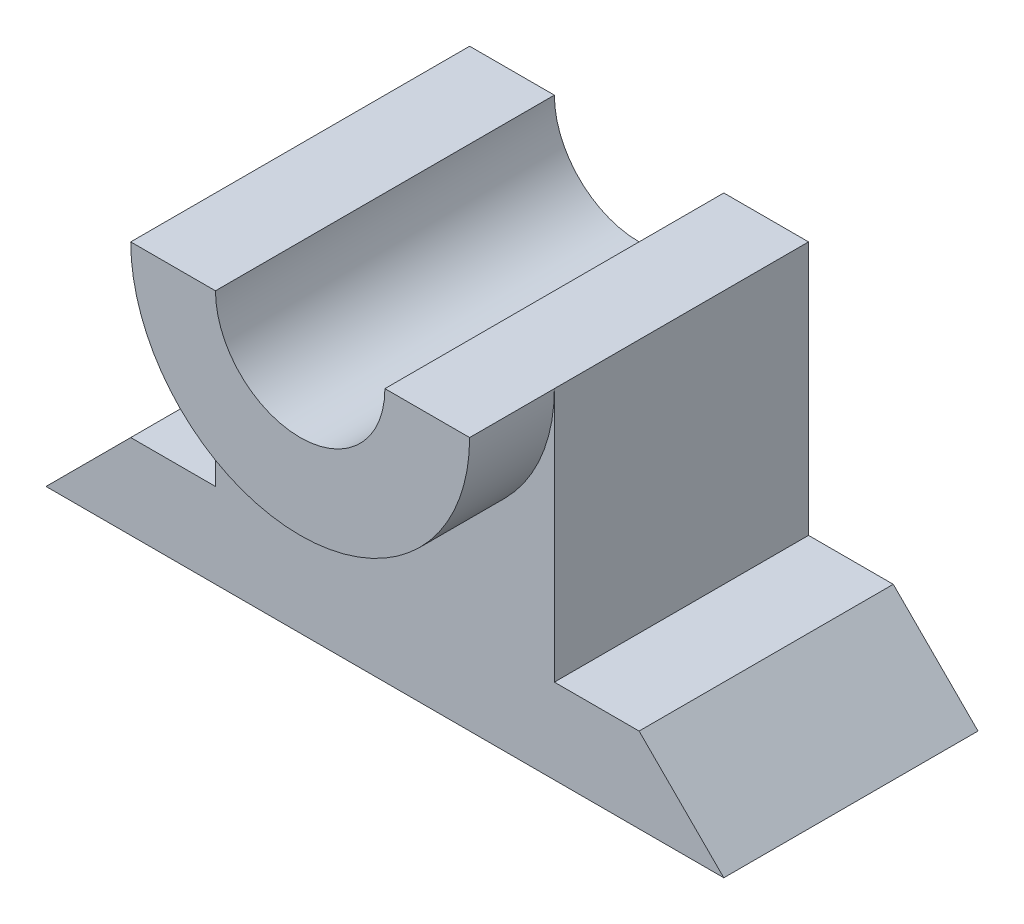
ISO-10303-21;
HEADER;
FILE_DESCRIPTION(('STEP AP214'),'2;1');
FILE_NAME('part.step','',(''),(''),'','','');
FILE_SCHEMA(('AUTOMOTIVE_DESIGN { 1 0 10303 214 1 1 1 1 }'));
ENDSEC;
DATA;
#1=APPLICATION_CONTEXT('core data for automotive mechanical design processes');
#2=APPLICATION_PROTOCOL_DEFINITION('international standard','automotive_design',2000,#1);
#3=PRODUCT_CONTEXT('',#1,'mechanical');
#4=PRODUCT('Part','Part','',(#3));
#5=PRODUCT_RELATED_PRODUCT_CATEGORY('part','',(#4));
#6=PRODUCT_DEFINITION_FORMATION('','',#4);
#7=PRODUCT_DEFINITION_CONTEXT('part definition',#1,'design');
#8=PRODUCT_DEFINITION('design','',#6,#7);
#9=PRODUCT_DEFINITION_SHAPE('','',#8);
#10=(LENGTH_UNIT() NAMED_UNIT(*) SI_UNIT(.MILLI.,.METRE.));
#11=(NAMED_UNIT(*) PLANE_ANGLE_UNIT() SI_UNIT($,.RADIAN.));
#12=(NAMED_UNIT(*) SI_UNIT($,.STERADIAN.) SOLID_ANGLE_UNIT());
#13=UNCERTAINTY_MEASURE_WITH_UNIT(LENGTH_MEASURE(1.E-05),#10,'distance_accuracy_value','');
#14=(GEOMETRIC_REPRESENTATION_CONTEXT(3) GLOBAL_UNCERTAINTY_ASSIGNED_CONTEXT((#13)) GLOBAL_UNIT_ASSIGNED_CONTEXT((#10,
#11,#12)) REPRESENTATION_CONTEXT('',''));
#15=CARTESIAN_POINT('',(0.,0.,0.));
#16=DIRECTION('',(0.,0.,1.));
#17=DIRECTION('',(1.,0.,0.));
#18=AXIS2_PLACEMENT_3D('',#15,#16,#17);
#19=CARTESIAN_POINT('',(2.,4.,3.));
#20=DIRECTION('',(0.,-1.,0.));
#21=DIRECTION('',(0.,0.,-1.));
#22=AXIS2_PLACEMENT_3D('',#19,#20,#21);
#23=PLANE('',#22);
#24=DIRECTION('',(-1.,0.,0.));
#25=VECTOR('',#24,1.);
#26=CARTESIAN_POINT('',(2.,4.,0.));
#27=LINE('',#26,#25);
#28=CARTESIAN_POINT('',(2.,4.,0.));
#29=VERTEX_POINT('',#28);
#30=CARTESIAN_POINT('',(1.,4.,0.));
#31=VERTEX_POINT('',#30);
#32=EDGE_CURVE('E199',#29,#31,#27,.T.);
#33=ORIENTED_EDGE('',*,*,#32,.T.);
#34=DIRECTION('',(0.,0.,-1.));
#35=VECTOR('',#34,1.);
#36=CARTESIAN_POINT('',(1.,4.,4.));
#37=LINE('',#36,#35);
#38=CARTESIAN_POINT('',(1.,4.,4.));
#39=VERTEX_POINT('',#38);
#40=EDGE_CURVE('E54',#39,#31,#37,.T.);
#41=ORIENTED_EDGE('',*,*,#40,.F.);
#42=DIRECTION('',(-1.,0.,0.));
#43=VECTOR('',#42,1.);
#44=CARTESIAN_POINT('',(0.,4.,4.));
#45=LINE('',#44,#43);
#46=CARTESIAN_POINT('',(2.,4.,4.));
#47=VERTEX_POINT('',#46);
#48=EDGE_CURVE('E142',#47,#39,#45,.T.);
#49=ORIENTED_EDGE('',*,*,#48,.F.);
#50=DIRECTION('',(0.,0.,-1.));
#51=VECTOR('',#50,1.);
#52=CARTESIAN_POINT('',(2.,4.,4.));
#53=LINE('',#52,#51);
#54=CARTESIAN_POINT('',(2.,4.,3.));
#55=VERTEX_POINT('',#54);
#56=EDGE_CURVE('E139',#47,#55,#53,.T.);
#57=ORIENTED_EDGE('',*,*,#56,.T.);
#58=DIRECTION('',(0.,0.,-1.));
#59=VECTOR('',#58,1.);
#60=CARTESIAN_POINT('',(2.,4.,3.));
#61=LINE('',#60,#59);
#62=EDGE_CURVE('E204',#55,#29,#61,.T.);
#63=ORIENTED_EDGE('',*,*,#62,.T.);
#64=EDGE_LOOP('',(#33,#41,#49,#57,#63));
#65=FACE_BOUND('',#64,.T.);
#66=ADVANCED_FACE('F39',(#65),#23,.F.);
#67=CARTESIAN_POINT('',(0.,0.,0.));
#68=DIRECTION('',(0.,0.,1.));
#69=DIRECTION('',(1.,0.,0.));
#70=AXIS2_PLACEMENT_3D('',#67,#68,#69);
#71=PLANE('',#70);
#72=CARTESIAN_POINT('',(0.,4.,0.));
#73=DIRECTION('',(0.,0.,1.));
#74=DIRECTION('',(1.,0.,0.));
#75=AXIS2_PLACEMENT_3D('',#72,#73,#74);
#76=CIRCLE('',#75,1.);
#77=CARTESIAN_POINT('',(-1.,4.,0.));
#78=VERTEX_POINT('',#77);
#79=EDGE_CURVE('E143',#78,#31,#76,.T.);
#80=ORIENTED_EDGE('',*,*,#79,.T.);
#81=ORIENTED_EDGE('',*,*,#32,.F.);
#82=DIRECTION('',(0.,1.,0.));
#83=VECTOR('',#82,1.);
#84=CARTESIAN_POINT('',(2.,0.999999999999999,0.));
#85=LINE('',#84,#83);
#86=CARTESIAN_POINT('',(2.,0.999999999999999,0.));
#87=VERTEX_POINT('',#86);
#88=EDGE_CURVE('E84',#87,#29,#85,.T.);
#89=ORIENTED_EDGE('',*,*,#88,.F.);
#90=DIRECTION('',(-1.,0.,0.));
#91=VECTOR('',#90,1.);
#92=CARTESIAN_POINT('',(3.,1.,0.));
#93=LINE('',#92,#91);
#94=CARTESIAN_POINT('',(3.,1.,0.));
#95=VERTEX_POINT('',#94);
#96=EDGE_CURVE('E208',#95,#87,#93,.T.);
#97=ORIENTED_EDGE('',*,*,#96,.F.);
#98=DIRECTION('',(-0.707106781186548,0.707106781186547,0.));
#99=VECTOR('',#98,1.);
#100=CARTESIAN_POINT('',(4.,0.,0.));
#101=LINE('',#100,#99);
#102=CARTESIAN_POINT('',(4.,0.,0.));
#103=VERTEX_POINT('',#102);
#104=EDGE_CURVE('E206',#103,#95,#101,.T.);
#105=ORIENTED_EDGE('',*,*,#104,.F.);
#106=DIRECTION('',(1.,0.,0.));
#107=VECTOR('',#106,1.);
#108=CARTESIAN_POINT('',(0.,0.,0.));
#109=LINE('',#108,#107);
#110=CARTESIAN_POINT('',(-4.,0.,0.));
#111=VERTEX_POINT('',#110);
#112=EDGE_CURVE('E196',#111,#103,#109,.T.);
#113=ORIENTED_EDGE('',*,*,#112,.F.);
#114=DIRECTION('',(0.707106781186548,0.707106781186547,0.));
#115=VECTOR('',#114,1.);
#116=CARTESIAN_POINT('',(-4.,0.,0.));
#117=LINE('',#116,#115);
#118=CARTESIAN_POINT('',(-3.,1.,0.));
#119=VERTEX_POINT('',#118);
#120=EDGE_CURVE('E158',#111,#119,#117,.T.);
#121=ORIENTED_EDGE('',*,*,#120,.T.);
#122=DIRECTION('',(1.,0.,0.));
#123=VECTOR('',#122,1.);
#124=CARTESIAN_POINT('',(-3.,1.,0.));
#125=LINE('',#124,#123);
#126=CARTESIAN_POINT('',(-2.,0.999999999999999,0.));
#127=VERTEX_POINT('',#126);
#128=EDGE_CURVE('E161',#119,#127,#125,.T.);
#129=ORIENTED_EDGE('',*,*,#128,.T.);
#130=DIRECTION('',(0.,1.,0.));
#131=VECTOR('',#130,1.);
#132=CARTESIAN_POINT('',(-2.,0.999999999999999,0.));
#133=LINE('',#132,#131);
#134=CARTESIAN_POINT('',(-2.,4.,0.));
#135=VERTEX_POINT('',#134);
#136=EDGE_CURVE('E177',#127,#135,#133,.T.);
#137=ORIENTED_EDGE('',*,*,#136,.T.);
#138=DIRECTION('',(1.,0.,0.));
#139=VECTOR('',#138,1.);
#140=CARTESIAN_POINT('',(-2.,4.,0.));
#141=LINE('',#140,#139);
#142=EDGE_CURVE('E169',#135,#78,#141,.T.);
#143=ORIENTED_EDGE('',*,*,#142,.T.);
#144=EDGE_LOOP('',(#80,#81,#89,#97,#105,#113,#121,#129,#137,#143));
#145=FACE_BOUND('',#144,.T.);
#146=ADVANCED_FACE('F226',(#145),#71,.F.);
#147=CARTESIAN_POINT('',(0.,0.,3.));
#148=DIRECTION('',(0.,1.,0.));
#149=DIRECTION('',(0.,0.,1.));
#150=AXIS2_PLACEMENT_3D('',#147,#148,#149);
#151=PLANE('',#150);
#152=ORIENTED_EDGE('',*,*,#112,.T.);
#153=DIRECTION('',(0.,0.,-1.));
#154=VECTOR('',#153,1.);
#155=CARTESIAN_POINT('',(4.,0.,3.));
#156=LINE('',#155,#154);
#157=CARTESIAN_POINT('',(4.,0.,3.));
#158=VERTEX_POINT('',#157);
#159=EDGE_CURVE('E11',#158,#103,#156,.T.);
#160=ORIENTED_EDGE('',*,*,#159,.F.);
#161=DIRECTION('',(1.,0.,0.));
#162=VECTOR('',#161,1.);
#163=CARTESIAN_POINT('',(0.,0.,3.));
#164=LINE('',#163,#162);
#165=CARTESIAN_POINT('',(-4.,0.,3.));
#166=VERTEX_POINT('',#165);
#167=EDGE_CURVE('E91',#166,#158,#164,.T.);
#168=ORIENTED_EDGE('',*,*,#167,.F.);
#169=DIRECTION('',(0.,0.,-1.));
#170=VECTOR('',#169,1.);
#171=CARTESIAN_POINT('',(-4.,0.,3.));
#172=LINE('',#171,#170);
#173=EDGE_CURVE('E186',#166,#111,#172,.T.);
#174=ORIENTED_EDGE('',*,*,#173,.T.);
#175=EDGE_LOOP('',(#152,#160,#168,#174));
#176=FACE_BOUND('',#175,.T.);
#177=ADVANCED_FACE('F41',(#176),#151,.F.);
#178=CARTESIAN_POINT('',(4.,0.,3.));
#179=DIRECTION('',(-0.707106781186547,-0.707106781186548,0.));
#180=DIRECTION('',(0.707106781186548,-0.707106781186547,0.));
#181=AXIS2_PLACEMENT_3D('',#178,#179,#180);
#182=PLANE('',#181);
#183=ORIENTED_EDGE('',*,*,#104,.T.);
#184=DIRECTION('',(0.,0.,-1.));
#185=VECTOR('',#184,1.);
#186=CARTESIAN_POINT('',(3.,1.,3.));
#187=LINE('',#186,#185);
#188=CARTESIAN_POINT('',(3.,1.,3.));
#189=VERTEX_POINT('',#188);
#190=EDGE_CURVE('E47',#189,#95,#187,.T.);
#191=ORIENTED_EDGE('',*,*,#190,.F.);
#192=DIRECTION('',(-0.707106781186548,0.707106781186547,0.));
#193=VECTOR('',#192,1.);
#194=CARTESIAN_POINT('',(4.,0.,3.));
#195=LINE('',#194,#193);
#196=EDGE_CURVE('E198',#158,#189,#195,.T.);
#197=ORIENTED_EDGE('',*,*,#196,.F.);
#198=ORIENTED_EDGE('',*,*,#159,.T.);
#199=EDGE_LOOP('',(#183,#191,#197,#198));
#200=FACE_BOUND('',#199,.T.);
#201=ADVANCED_FACE('F244',(#200),#182,.F.);
#202=CARTESIAN_POINT('',(3.,1.,3.));
#203=DIRECTION('',(0.,-1.,0.));
#204=DIRECTION('',(1.,0.,0.));
#205=AXIS2_PLACEMENT_3D('',#202,#203,#204);
#206=PLANE('',#205);
#207=ORIENTED_EDGE('',*,*,#96,.T.);
#208=DIRECTION('',(0.,0.,-1.));
#209=VECTOR('',#208,1.);
#210=CARTESIAN_POINT('',(2.,0.999999999999999,3.));
#211=LINE('',#210,#209);
#212=CARTESIAN_POINT('',(2.,0.999999999999999,3.));
#213=VERTEX_POINT('',#212);
#214=EDGE_CURVE('E214',#213,#87,#211,.T.);
#215=ORIENTED_EDGE('',*,*,#214,.F.);
#216=DIRECTION('',(-1.,0.,0.));
#217=VECTOR('',#216,1.);
#218=CARTESIAN_POINT('',(3.,1.,3.));
#219=LINE('',#218,#217);
#220=EDGE_CURVE('E201',#189,#213,#219,.T.);
#221=ORIENTED_EDGE('',*,*,#220,.F.);
#222=ORIENTED_EDGE('',*,*,#190,.T.);
#223=EDGE_LOOP('',(#207,#215,#221,#222));
#224=FACE_BOUND('',#223,.T.);
#225=ADVANCED_FACE('F220',(#224),#206,.F.);
#226=CARTESIAN_POINT('',(2.,0.999999999999999,3.));
#227=DIRECTION('',(-1.,0.,0.));
#228=DIRECTION('',(0.,-1.,0.));
#229=AXIS2_PLACEMENT_3D('',#226,#227,#228);
#230=PLANE('',#229);
#231=ORIENTED_EDGE('',*,*,#88,.T.);
#232=ORIENTED_EDGE('',*,*,#62,.F.);
#233=DIRECTION('',(0.,1.,0.));
#234=VECTOR('',#233,1.);
#235=CARTESIAN_POINT('',(2.,0.999999999999999,3.));
#236=LINE('',#235,#234);
#237=EDGE_CURVE('E63',#213,#55,#236,.T.);
#238=ORIENTED_EDGE('',*,*,#237,.F.);
#239=ORIENTED_EDGE('',*,*,#214,.T.);
#240=EDGE_LOOP('',(#231,#232,#238,#239));
#241=FACE_BOUND('',#240,.T.);
#242=ADVANCED_FACE('F229',(#241),#230,.F.);
#243=CARTESIAN_POINT('',(0.,0.,3.));
#244=DIRECTION('',(0.,0.,1.));
#245=DIRECTION('',(1.,0.,0.));
#246=AXIS2_PLACEMENT_3D('',#243,#244,#245);
#247=PLANE('',#246);
#248=ORIENTED_EDGE('',*,*,#237,.T.);
#249=CARTESIAN_POINT('',(0.,4.,3.));
#250=DIRECTION('',(0.,0.,1.));
#251=DIRECTION('',(1.,0.,0.));
#252=AXIS2_PLACEMENT_3D('',#249,#250,#251);
#253=CIRCLE('',#252,2.);
#254=CARTESIAN_POINT('',(-2.,4.,3.));
#255=VERTEX_POINT('',#254);
#256=EDGE_CURVE('E194',#55,#255,#253,.F.);
#257=ORIENTED_EDGE('',*,*,#256,.T.);
#258=DIRECTION('',(0.,1.,0.));
#259=VECTOR('',#258,1.);
#260=CARTESIAN_POINT('',(-2.,0.999999999999999,3.));
#261=LINE('',#260,#259);
#262=CARTESIAN_POINT('',(-2.,0.999999999999999,3.));
#263=VERTEX_POINT('',#262);
#264=EDGE_CURVE('E172',#263,#255,#261,.T.);
#265=ORIENTED_EDGE('',*,*,#264,.F.);
#266=DIRECTION('',(1.,0.,0.));
#267=VECTOR('',#266,1.);
#268=CARTESIAN_POINT('',(-3.,1.,3.));
#269=LINE('',#268,#267);
#270=CARTESIAN_POINT('',(-3.,1.,3.));
#271=VERTEX_POINT('',#270);
#272=EDGE_CURVE('E168',#271,#263,#269,.T.);
#273=ORIENTED_EDGE('',*,*,#272,.F.);
#274=DIRECTION('',(0.707106781186548,0.707106781186547,0.));
#275=VECTOR('',#274,1.);
#276=CARTESIAN_POINT('',(-4.,0.,3.));
#277=LINE('',#276,#275);
#278=EDGE_CURVE('E165',#166,#271,#277,.T.);
#279=ORIENTED_EDGE('',*,*,#278,.F.);
#280=ORIENTED_EDGE('',*,*,#167,.T.);
#281=ORIENTED_EDGE('',*,*,#196,.T.);
#282=ORIENTED_EDGE('',*,*,#220,.T.);
#283=EDGE_LOOP('',(#248,#257,#265,#273,#279,#280,#281,#282));
#284=FACE_BOUND('',#283,.T.);
#285=ADVANCED_FACE('F230',(#284),#247,.T.);
#286=CARTESIAN_POINT('',(0.,4.,4.));
#287=DIRECTION('',(0.,0.,-1.));
#288=DIRECTION('',(-1.,0.,0.));
#289=AXIS2_PLACEMENT_3D('',#286,#287,#288);
#290=CYLINDRICAL_SURFACE('',#289,2.);
#291=ORIENTED_EDGE('',*,*,#256,.F.);
#292=ORIENTED_EDGE('',*,*,#56,.F.);
#293=CARTESIAN_POINT('',(0.,4.,4.));
#294=DIRECTION('',(0.,0.,1.));
#295=DIRECTION('',(1.,0.,0.));
#296=AXIS2_PLACEMENT_3D('',#293,#294,#295);
#297=CIRCLE('',#296,2.);
#298=CARTESIAN_POINT('',(-2.,4.,4.));
#299=VERTEX_POINT('',#298);
#300=EDGE_CURVE('E131',#299,#47,#297,.T.);
#301=ORIENTED_EDGE('',*,*,#300,.F.);
#302=DIRECTION('',(0.,0.,-1.));
#303=VECTOR('',#302,1.);
#304=CARTESIAN_POINT('',(-2.,4.,4.));
#305=LINE('',#304,#303);
#306=EDGE_CURVE('E136',#299,#255,#305,.T.);
#307=ORIENTED_EDGE('',*,*,#306,.T.);
#308=EDGE_LOOP('',(#291,#292,#301,#307));
#309=FACE_BOUND('',#308,.T.);
#310=ADVANCED_FACE('F134',(#309),#290,.T.);
#311=CARTESIAN_POINT('',(0.,4.,4.));
#312=DIRECTION('',(0.,0.,-1.));
#313=DIRECTION('',(-1.,0.,0.));
#314=AXIS2_PLACEMENT_3D('',#311,#312,#313);
#315=CYLINDRICAL_SURFACE('',#314,1.);
#316=ORIENTED_EDGE('',*,*,#40,.T.);
#317=ORIENTED_EDGE('',*,*,#79,.F.);
#318=DIRECTION('',(0.,0.,-1.));
#319=VECTOR('',#318,1.);
#320=CARTESIAN_POINT('',(-1.,4.,4.));
#321=LINE('',#320,#319);
#322=CARTESIAN_POINT('',(-1.,4.,4.));
#323=VERTEX_POINT('',#322);
#324=EDGE_CURVE('E152',#323,#78,#321,.T.);
#325=ORIENTED_EDGE('',*,*,#324,.F.);
#326=CARTESIAN_POINT('',(0.,4.,4.));
#327=DIRECTION('',(0.,0.,1.));
#328=DIRECTION('',(1.,0.,0.));
#329=AXIS2_PLACEMENT_3D('',#326,#327,#328);
#330=CIRCLE('',#329,1.);
#331=EDGE_CURVE('E148',#323,#39,#330,.T.);
#332=ORIENTED_EDGE('',*,*,#331,.T.);
#333=EDGE_LOOP('',(#316,#317,#325,#332));
#334=FACE_BOUND('',#333,.T.);
#335=ADVANCED_FACE('F266',(#334),#315,.F.);
#336=CARTESIAN_POINT('',(0.,0.,4.));
#337=DIRECTION('',(0.,0.,1.));
#338=DIRECTION('',(1.,0.,0.));
#339=AXIS2_PLACEMENT_3D('',#336,#337,#338);
#340=PLANE('',#339);
#341=ORIENTED_EDGE('',*,*,#331,.F.);
#342=DIRECTION('',(1.,0.,0.));
#343=VECTOR('',#342,1.);
#344=CARTESIAN_POINT('',(0.,4.,4.));
#345=LINE('',#344,#343);
#346=EDGE_CURVE('E146',#299,#323,#345,.T.);
#347=ORIENTED_EDGE('',*,*,#346,.F.);
#348=ORIENTED_EDGE('',*,*,#300,.T.);
#349=ORIENTED_EDGE('',*,*,#48,.T.);
#350=EDGE_LOOP('',(#341,#347,#348,#349));
#351=FACE_BOUND('',#350,.T.);
#352=ADVANCED_FACE('F147',(#351),#340,.T.);
#353=CARTESIAN_POINT('',(-2.,4.,3.));
#354=DIRECTION('',(0.,-1.,0.));
#355=DIRECTION('',(0.,0.,-1.));
#356=AXIS2_PLACEMENT_3D('',#353,#354,#355);
#357=PLANE('',#356);
#358=ORIENTED_EDGE('',*,*,#142,.F.);
#359=DIRECTION('',(0.,0.,-1.));
#360=VECTOR('',#359,1.);
#361=CARTESIAN_POINT('',(-2.,4.,3.));
#362=LINE('',#361,#360);
#363=EDGE_CURVE('E157',#255,#135,#362,.T.);
#364=ORIENTED_EDGE('',*,*,#363,.F.);
#365=ORIENTED_EDGE('',*,*,#306,.F.);
#366=ORIENTED_EDGE('',*,*,#346,.T.);
#367=ORIENTED_EDGE('',*,*,#324,.T.);
#368=EDGE_LOOP('',(#358,#364,#365,#366,#367));
#369=FACE_BOUND('',#368,.T.);
#370=ADVANCED_FACE('F155',(#369),#357,.F.);
#371=CARTESIAN_POINT('',(-4.,0.,3.));
#372=DIRECTION('',(0.707106781186547,-0.707106781186548,0.));
#373=DIRECTION('',(-0.707106781186548,-0.707106781186547,0.));
#374=AXIS2_PLACEMENT_3D('',#371,#372,#373);
#375=PLANE('',#374);
#376=ORIENTED_EDGE('',*,*,#120,.F.);
#377=ORIENTED_EDGE('',*,*,#173,.F.);
#378=ORIENTED_EDGE('',*,*,#278,.T.);
#379=DIRECTION('',(0.,0.,-1.));
#380=VECTOR('',#379,1.);
#381=CARTESIAN_POINT('',(-3.,1.,3.));
#382=LINE('',#381,#380);
#383=EDGE_CURVE('E184',#271,#119,#382,.T.);
#384=ORIENTED_EDGE('',*,*,#383,.T.);
#385=EDGE_LOOP('',(#376,#377,#378,#384));
#386=FACE_BOUND('',#385,.T.);
#387=ADVANCED_FACE('F242',(#386),#375,.F.);
#388=CARTESIAN_POINT('',(-3.,1.,3.));
#389=DIRECTION('',(0.,-1.,0.));
#390=DIRECTION('',(-1.,0.,0.));
#391=AXIS2_PLACEMENT_3D('',#388,#389,#390);
#392=PLANE('',#391);
#393=ORIENTED_EDGE('',*,*,#128,.F.);
#394=ORIENTED_EDGE('',*,*,#383,.F.);
#395=ORIENTED_EDGE('',*,*,#272,.T.);
#396=DIRECTION('',(0.,0.,-1.));
#397=VECTOR('',#396,1.);
#398=CARTESIAN_POINT('',(-2.,0.999999999999999,3.));
#399=LINE('',#398,#397);
#400=EDGE_CURVE('E182',#263,#127,#399,.T.);
#401=ORIENTED_EDGE('',*,*,#400,.T.);
#402=EDGE_LOOP('',(#393,#394,#395,#401));
#403=FACE_BOUND('',#402,.T.);
#404=ADVANCED_FACE('F238',(#403),#392,.F.);
#405=CARTESIAN_POINT('',(-2.,0.999999999999999,3.));
#406=DIRECTION('',(1.,0.,0.));
#407=DIRECTION('',(0.,-1.,0.));
#408=AXIS2_PLACEMENT_3D('',#405,#406,#407);
#409=PLANE('',#408);
#410=ORIENTED_EDGE('',*,*,#136,.F.);
#411=ORIENTED_EDGE('',*,*,#400,.F.);
#412=ORIENTED_EDGE('',*,*,#264,.T.);
#413=ORIENTED_EDGE('',*,*,#363,.T.);
#414=EDGE_LOOP('',(#410,#411,#412,#413));
#415=FACE_BOUND('',#414,.T.);
#416=ADVANCED_FACE('F234',(#415),#409,.F.);
#417=CLOSED_SHELL('',(#66,#146,#177,#201,#225,#242,#285,#310,#335,#352,#370,#387,#404,#416));
#418=MANIFOLD_SOLID_BREP('B2',#417);
#419=ADVANCED_BREP_SHAPE_REPRESENTATION('',(#18,#418),#14);
#420=SHAPE_DEFINITION_REPRESENTATION(#9,#419);
ENDSEC;
END-ISO-10303-21;
